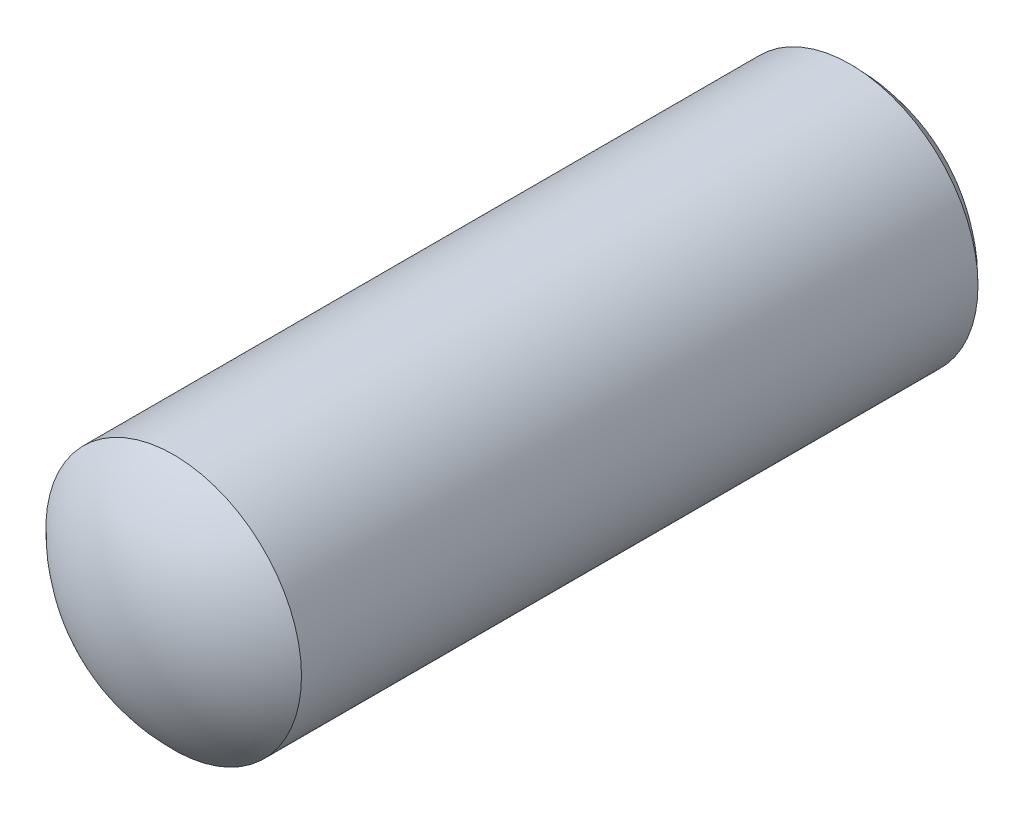
ISO-10303-21;
HEADER;
FILE_DESCRIPTION(('STEP AP214'),'2;1');
FILE_NAME('part.step','',(''),(''),'','','');
FILE_SCHEMA(('AUTOMOTIVE_DESIGN { 1 0 10303 214 1 1 1 1 }'));
ENDSEC;
DATA;
#1=APPLICATION_CONTEXT('core data for automotive mechanical design processes');
#2=APPLICATION_PROTOCOL_DEFINITION('international standard','automotive_design',2000,#1);
#3=PRODUCT_CONTEXT('',#1,'mechanical');
#4=PRODUCT('Part','Part','',(#3));
#5=PRODUCT_RELATED_PRODUCT_CATEGORY('part','',(#4));
#6=PRODUCT_DEFINITION_FORMATION('','',#4);
#7=PRODUCT_DEFINITION_CONTEXT('part definition',#1,'design');
#8=PRODUCT_DEFINITION('design','',#6,#7);
#9=PRODUCT_DEFINITION_SHAPE('','',#8);
#10=(LENGTH_UNIT() NAMED_UNIT(*) SI_UNIT(.MILLI.,.METRE.));
#11=(NAMED_UNIT(*) PLANE_ANGLE_UNIT() SI_UNIT($,.RADIAN.));
#12=(NAMED_UNIT(*) SI_UNIT($,.STERADIAN.) SOLID_ANGLE_UNIT());
#13=UNCERTAINTY_MEASURE_WITH_UNIT(LENGTH_MEASURE(1.E-05),#10,'distance_accuracy_value','');
#14=(GEOMETRIC_REPRESENTATION_CONTEXT(3) GLOBAL_UNCERTAINTY_ASSIGNED_CONTEXT((#13)) GLOBAL_UNIT_ASSIGNED_CONTEXT((#10,
#11,#12)) REPRESENTATION_CONTEXT('',''));
#15=CARTESIAN_POINT('',(0.,0.,0.));
#16=DIRECTION('',(0.,0.,1.));
#17=DIRECTION('',(1.,0.,0.));
#18=AXIS2_PLACEMENT_3D('',#15,#16,#17);
#19=CARTESIAN_POINT('',(-6.89621486598258,5.97560419725074,7.875));
#20=DIRECTION('',(0.654860733945285,0.755749574354258,0.));
#21=DIRECTION('',(0.,0.,1.));
#22=AXIS2_PLACEMENT_3D('',#19,#20,#21);
#23=SPHERICAL_SURFACE('',#22,1.575);
#24=CARTESIAN_POINT('',(-6.89621486598258,5.97560419725074,7.875));
#25=DIRECTION('',(0.,0.,1.));
#26=DIRECTION('',(0.755749574354258,-0.654860733945285,0.));
#27=AXIS2_PLACEMENT_3D('',#24,#25,#26);
#28=SPHERICAL_SURFACE('',#27,1.575);
#29=CARTESIAN_POINT('',(-6.89621486598258,5.97560419725074,8.97727038425245));
#30=DIRECTION('',(0.,0.,1.));
#31=DIRECTION('',(0.755749574354258,-0.654860733945285,0.));
#32=AXIS2_PLACEMENT_3D('',#29,#30,#31);
#33=CIRCLE('',#32,1.125);
#34=CARTESIAN_POINT('',(-6.04599659483404,5.23888587156229,8.97727038425245));
#35=VERTEX_POINT('',#34);
#36=EDGE_CURVE('E11',#35,#35,#33,.T.);
#37=ORIENTED_EDGE('',*,*,#36,.T.);
#38=EDGE_LOOP('',(#37));
#39=FACE_BOUND('',#38,.T.);
#40=ADVANCED_FACE('F17',(#39),#28,.T.);
#41=CARTESIAN_POINT('',(-6.89621486598258,5.97560419725074,6.));
#42=DIRECTION('',(0.,0.,1.));
#43=DIRECTION('',(0.755749574354258,-0.654860733945285,0.));
#44=AXIS2_PLACEMENT_3D('',#41,#42,#43);
#45=CYLINDRICAL_SURFACE('',#44,1.125);
#46=CARTESIAN_POINT('',(-6.89621486598258,5.97560419725074,3.02272961574759));
#47=DIRECTION('',(0.,0.,1.));
#48=DIRECTION('',(0.755749574354258,-0.654860733945285,0.));
#49=AXIS2_PLACEMENT_3D('',#46,#47,#48);
#50=CIRCLE('',#49,1.125);
#51=CARTESIAN_POINT('',(-6.04599659483404,5.23888587156229,3.02272961574759));
#52=VERTEX_POINT('',#51);
#53=EDGE_CURVE('E21',#52,#52,#50,.T.);
#54=ORIENTED_EDGE('',*,*,#53,.T.);
#55=EDGE_LOOP('',(#54));
#56=FACE_BOUND('',#55,.T.);
#57=ORIENTED_EDGE('',*,*,#36,.F.);
#58=EDGE_LOOP('',(#57));
#59=FACE_BOUND('',#58,.T.);
#60=ADVANCED_FACE('F19',(#56,#59),#45,.T.);
#61=CARTESIAN_POINT('',(-6.89621486598258,5.97560419725074,4.125));
#62=DIRECTION('',(0.654860733945285,0.755749574354258,0.));
#63=DIRECTION('',(0.,0.,-1.));
#64=AXIS2_PLACEMENT_3D('',#61,#62,#63);
#65=SPHERICAL_SURFACE('',#64,1.575);
#66=CARTESIAN_POINT('',(-6.89621486598258,5.97560419725074,4.125));
#67=DIRECTION('',(0.,0.,1.));
#68=DIRECTION('',(0.755749574354258,-0.654860733945285,0.));
#69=AXIS2_PLACEMENT_3D('',#66,#67,#68);
#70=SPHERICAL_SURFACE('',#69,1.575);
#71=ORIENTED_EDGE('',*,*,#53,.F.);
#72=EDGE_LOOP('',(#71));
#73=FACE_BOUND('',#72,.T.);
#74=ADVANCED_FACE('F57',(#73),#70,.T.);
#75=CLOSED_SHELL('',(#40,#60,#74));
#76=MANIFOLD_SOLID_BREP('B1',#75);
#77=ADVANCED_BREP_SHAPE_REPRESENTATION('',(#18,#76),#14);
#78=SHAPE_DEFINITION_REPRESENTATION(#9,#77);
ENDSEC;
END-ISO-10303-21;
